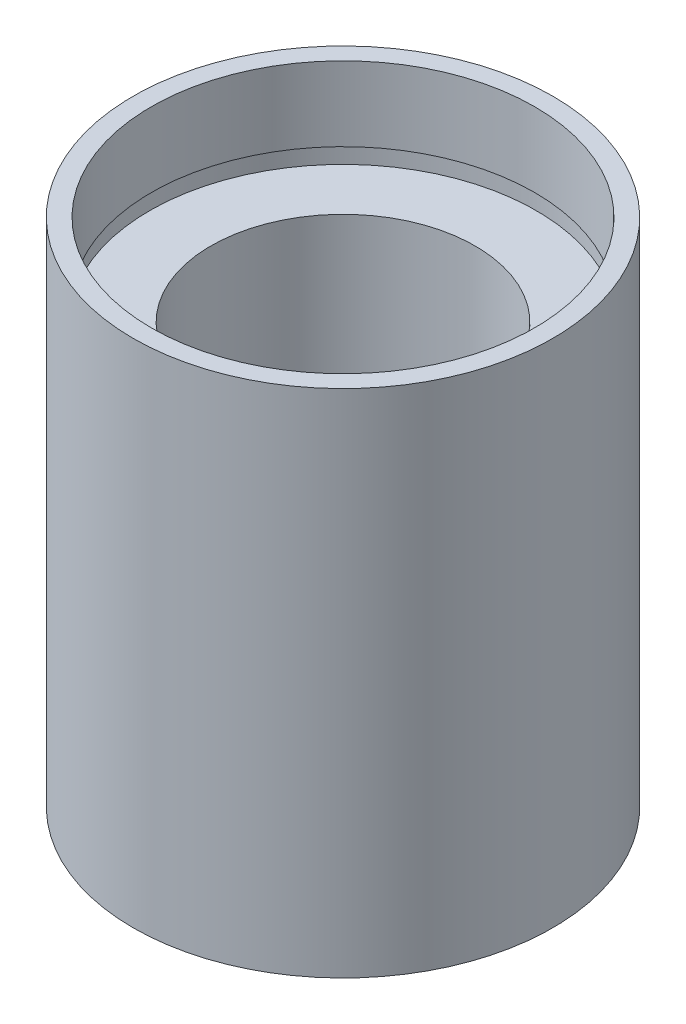
ISO-10303-21;
HEADER;
FILE_DESCRIPTION(('STEP AP214'),'2;1');
FILE_NAME('part.step','',(''),(''),'','','');
FILE_SCHEMA(('AUTOMOTIVE_DESIGN { 1 0 10303 214 1 1 1 1 }'));
ENDSEC;
DATA;
#1=APPLICATION_CONTEXT('core data for automotive mechanical design processes');
#2=APPLICATION_PROTOCOL_DEFINITION('international standard','automotive_design',2000,#1);
#3=PRODUCT_CONTEXT('',#1,'mechanical');
#4=PRODUCT('Part','Part','',(#3));
#5=PRODUCT_RELATED_PRODUCT_CATEGORY('part','',(#4));
#6=PRODUCT_DEFINITION_FORMATION('','',#4);
#7=PRODUCT_DEFINITION_CONTEXT('part definition',#1,'design');
#8=PRODUCT_DEFINITION('design','',#6,#7);
#9=PRODUCT_DEFINITION_SHAPE('','',#8);
#10=(LENGTH_UNIT() NAMED_UNIT(*) SI_UNIT(.MILLI.,.METRE.));
#11=(NAMED_UNIT(*) PLANE_ANGLE_UNIT() SI_UNIT($,.RADIAN.));
#12=(NAMED_UNIT(*) SI_UNIT($,.STERADIAN.) SOLID_ANGLE_UNIT());
#13=UNCERTAINTY_MEASURE_WITH_UNIT(LENGTH_MEASURE(1.E-05),#10,'distance_accuracy_value','');
#14=(GEOMETRIC_REPRESENTATION_CONTEXT(3) GLOBAL_UNCERTAINTY_ASSIGNED_CONTEXT((#13)) GLOBAL_UNIT_ASSIGNED_CONTEXT((#10,
#11,#12)) REPRESENTATION_CONTEXT('',''));
#15=CARTESIAN_POINT('',(0.,0.,0.));
#16=DIRECTION('',(0.,0.,1.));
#17=DIRECTION('',(1.,0.,0.));
#18=AXIS2_PLACEMENT_3D('',#15,#16,#17);
#19=CARTESIAN_POINT('',(11.1,0.,0.));
#20=DIRECTION('',(0.,1.,0.));
#21=DIRECTION('',(0.,0.,1.));
#22=AXIS2_PLACEMENT_3D('',#19,#20,#21);
#23=PLANE('',#22);
#24=CARTESIAN_POINT('',(0.,0.,0.));
#25=DIRECTION('',(0.,1.,0.));
#26=DIRECTION('',(0.,0.,1.));
#27=AXIS2_PLACEMENT_3D('',#24,#25,#26);
#28=CIRCLE('',#27,12.7);
#29=CARTESIAN_POINT('',(0.,0.,12.7));
#30=VERTEX_POINT('',#29);
#31=EDGE_CURVE('E10',#30,#30,#28,.T.);
#32=ORIENTED_EDGE('',*,*,#31,.F.);
#33=EDGE_LOOP('',(#32));
#34=FACE_BOUND('',#33,.T.);
#35=CARTESIAN_POINT('',(0.,0.,0.));
#36=DIRECTION('',(0.,1.,0.));
#37=DIRECTION('',(0.,0.,1.));
#38=AXIS2_PLACEMENT_3D('',#35,#36,#37);
#39=CIRCLE('',#38,11.1);
#40=CARTESIAN_POINT('',(0.,0.,11.1));
#41=VERTEX_POINT('',#40);
#42=EDGE_CURVE('E77',#41,#41,#39,.T.);
#43=ORIENTED_EDGE('',*,*,#42,.T.);
#44=EDGE_LOOP('',(#43));
#45=FACE_BOUND('',#44,.T.);
#46=ADVANCED_FACE('F37',(#34,#45),#23,.F.);
#47=CARTESIAN_POINT('',(0.,161.376166943427,0.));
#48=DIRECTION('',(0.,1.,0.));
#49=DIRECTION('',(0.,0.,1.));
#50=AXIS2_PLACEMENT_3D('',#47,#48,#49);
#51=CYLINDRICAL_SURFACE('',#50,12.7);
#52=CARTESIAN_POINT('',(0.,30.9,0.));
#53=DIRECTION('',(0.,1.,0.));
#54=DIRECTION('',(0.,0.,1.));
#55=AXIS2_PLACEMENT_3D('',#52,#53,#54);
#56=CIRCLE('',#55,12.7);
#57=CARTESIAN_POINT('',(0.,30.9,12.7));
#58=VERTEX_POINT('',#57);
#59=EDGE_CURVE('E43',#58,#58,#56,.T.);
#60=ORIENTED_EDGE('',*,*,#59,.F.);
#61=EDGE_LOOP('',(#60));
#62=FACE_BOUND('',#61,.T.);
#63=ORIENTED_EDGE('',*,*,#31,.T.);
#64=EDGE_LOOP('',(#63));
#65=FACE_BOUND('',#64,.T.);
#66=ADVANCED_FACE('F138',(#62,#65),#51,.T.);
#67=CARTESIAN_POINT('',(11.6,30.9,0.));
#68=DIRECTION('',(0.,-1.,0.));
#69=DIRECTION('',(0.,0.,-1.));
#70=AXIS2_PLACEMENT_3D('',#67,#68,#69);
#71=PLANE('',#70);
#72=CARTESIAN_POINT('',(0.,30.9,0.));
#73=DIRECTION('',(0.,1.,0.));
#74=DIRECTION('',(0.,0.,1.));
#75=AXIS2_PLACEMENT_3D('',#72,#73,#74);
#76=CIRCLE('',#75,11.6);
#77=CARTESIAN_POINT('',(0.,30.9,11.6));
#78=VERTEX_POINT('',#77);
#79=EDGE_CURVE('E47',#78,#78,#76,.T.);
#80=ORIENTED_EDGE('',*,*,#79,.F.);
#81=EDGE_LOOP('',(#80));
#82=FACE_BOUND('',#81,.T.);
#83=ORIENTED_EDGE('',*,*,#59,.T.);
#84=EDGE_LOOP('',(#83));
#85=FACE_BOUND('',#84,.T.);
#86=ADVANCED_FACE('F133',(#82,#85),#71,.F.);
#87=CARTESIAN_POINT('',(0.,161.376166943427,0.));
#88=DIRECTION('',(0.,1.,0.));
#89=DIRECTION('',(0.,0.,1.));
#90=AXIS2_PLACEMENT_3D('',#87,#88,#89);
#91=CYLINDRICAL_SURFACE('',#90,11.6);
#92=CARTESIAN_POINT('',(0.,26.4,0.));
#93=DIRECTION('',(0.,1.,0.));
#94=DIRECTION('',(0.,0.,1.));
#95=AXIS2_PLACEMENT_3D('',#92,#93,#94);
#96=CIRCLE('',#95,11.6);
#97=CARTESIAN_POINT('',(0.,26.4,11.6));
#98=VERTEX_POINT('',#97);
#99=EDGE_CURVE('E51',#98,#98,#96,.T.);
#100=ORIENTED_EDGE('',*,*,#99,.F.);
#101=EDGE_LOOP('',(#100));
#102=FACE_BOUND('',#101,.T.);
#103=ORIENTED_EDGE('',*,*,#79,.T.);
#104=EDGE_LOOP('',(#103));
#105=FACE_BOUND('',#104,.T.);
#106=ADVANCED_FACE('F127',(#102,#105),#91,.F.);
#107=CARTESIAN_POINT('',(11.6,26.4,0.));
#108=DIRECTION('',(0.,1.,0.));
#109=DIRECTION('',(0.,0.,1.));
#110=AXIS2_PLACEMENT_3D('',#107,#108,#109);
#111=PLANE('',#110);
#112=CARTESIAN_POINT('',(0.,26.4,0.));
#113=DIRECTION('',(0.,1.,0.));
#114=DIRECTION('',(0.,0.,1.));
#115=AXIS2_PLACEMENT_3D('',#112,#113,#114);
#116=CIRCLE('',#115,11.7);
#117=CARTESIAN_POINT('',(0.,26.4,11.7));
#118=VERTEX_POINT('',#117);
#119=EDGE_CURVE('E56',#118,#118,#116,.T.);
#120=ORIENTED_EDGE('',*,*,#119,.F.);
#121=EDGE_LOOP('',(#120));
#122=FACE_BOUND('',#121,.T.);
#123=ORIENTED_EDGE('',*,*,#99,.T.);
#124=EDGE_LOOP('',(#123));
#125=FACE_BOUND('',#124,.T.);
#126=ADVANCED_FACE('F121',(#122,#125),#111,.F.);
#127=CARTESIAN_POINT('',(0.,161.376166943427,0.));
#128=DIRECTION('',(0.,1.,0.));
#129=DIRECTION('',(0.,0.,1.));
#130=AXIS2_PLACEMENT_3D('',#127,#128,#129);
#131=CYLINDRICAL_SURFACE('',#130,11.7);
#132=CARTESIAN_POINT('',(0.,25.4,0.));
#133=DIRECTION('',(0.,1.,0.));
#134=DIRECTION('',(0.,0.,1.));
#135=AXIS2_PLACEMENT_3D('',#132,#133,#134);
#136=CIRCLE('',#135,11.7);
#137=CARTESIAN_POINT('',(0.,25.4,11.7));
#138=VERTEX_POINT('',#137);
#139=EDGE_CURVE('E59',#138,#138,#136,.T.);
#140=ORIENTED_EDGE('',*,*,#139,.F.);
#141=EDGE_LOOP('',(#140));
#142=FACE_BOUND('',#141,.T.);
#143=ORIENTED_EDGE('',*,*,#119,.T.);
#144=EDGE_LOOP('',(#143));
#145=FACE_BOUND('',#144,.T.);
#146=ADVANCED_FACE('F115',(#142,#145),#131,.F.);
#147=CARTESIAN_POINT('',(8.00000000000002,25.4,0.));
#148=DIRECTION('',(0.,-1.,0.));
#149=DIRECTION('',(0.,0.,-1.));
#150=AXIS2_PLACEMENT_3D('',#147,#148,#149);
#151=PLANE('',#150);
#152=CARTESIAN_POINT('',(0.,25.4,0.));
#153=DIRECTION('',(0.,1.,0.));
#154=DIRECTION('',(0.,0.,1.));
#155=AXIS2_PLACEMENT_3D('',#152,#153,#154);
#156=CIRCLE('',#155,8.00000000000002);
#157=CARTESIAN_POINT('',(0.,25.4,8.00000000000002));
#158=VERTEX_POINT('',#157);
#159=EDGE_CURVE('E62',#158,#158,#156,.T.);
#160=ORIENTED_EDGE('',*,*,#159,.F.);
#161=EDGE_LOOP('',(#160));
#162=FACE_BOUND('',#161,.T.);
#163=ORIENTED_EDGE('',*,*,#139,.T.);
#164=EDGE_LOOP('',(#163));
#165=FACE_BOUND('',#164,.T.);
#166=ADVANCED_FACE('F109',(#162,#165),#151,.F.);
#167=CARTESIAN_POINT('',(0.,161.376166943427,0.));
#168=DIRECTION('',(0.,1.,0.));
#169=DIRECTION('',(0.,0.,1.));
#170=AXIS2_PLACEMENT_3D('',#167,#168,#169);
#171=CYLINDRICAL_SURFACE('',#170,8.00000000000002);
#172=CARTESIAN_POINT('',(0.,5.49999999999998,0.));
#173=DIRECTION('',(0.,1.,0.));
#174=DIRECTION('',(0.,0.,1.));
#175=AXIS2_PLACEMENT_3D('',#172,#173,#174);
#176=CIRCLE('',#175,8.00000000000002);
#177=CARTESIAN_POINT('',(0.,5.49999999999998,8.00000000000002));
#178=VERTEX_POINT('',#177);
#179=EDGE_CURVE('E65',#178,#178,#176,.T.);
#180=ORIENTED_EDGE('',*,*,#179,.F.);
#181=EDGE_LOOP('',(#180));
#182=FACE_BOUND('',#181,.T.);
#183=ORIENTED_EDGE('',*,*,#159,.T.);
#184=EDGE_LOOP('',(#183));
#185=FACE_BOUND('',#184,.T.);
#186=ADVANCED_FACE('F103',(#182,#185),#171,.F.);
#187=CARTESIAN_POINT('',(11.7,5.49999999999999,0.));
#188=DIRECTION('',(0.,1.,0.));
#189=DIRECTION('',(0.,0.,1.));
#190=AXIS2_PLACEMENT_3D('',#187,#188,#189);
#191=PLANE('',#190);
#192=CARTESIAN_POINT('',(0.,5.49999999999998,0.));
#193=DIRECTION('',(0.,1.,0.));
#194=DIRECTION('',(0.,0.,1.));
#195=AXIS2_PLACEMENT_3D('',#192,#193,#194);
#196=CIRCLE('',#195,11.7);
#197=CARTESIAN_POINT('',(0.,5.49999999999998,11.7));
#198=VERTEX_POINT('',#197);
#199=EDGE_CURVE('E68',#198,#198,#196,.T.);
#200=ORIENTED_EDGE('',*,*,#199,.F.);
#201=EDGE_LOOP('',(#200));
#202=FACE_BOUND('',#201,.T.);
#203=ORIENTED_EDGE('',*,*,#179,.T.);
#204=EDGE_LOOP('',(#203));
#205=FACE_BOUND('',#204,.T.);
#206=ADVANCED_FACE('F97',(#202,#205),#191,.F.);
#207=CARTESIAN_POINT('',(0.,161.376166943427,0.));
#208=DIRECTION('',(0.,1.,0.));
#209=DIRECTION('',(0.,0.,1.));
#210=AXIS2_PLACEMENT_3D('',#207,#208,#209);
#211=CYLINDRICAL_SURFACE('',#210,11.7);
#212=CARTESIAN_POINT('',(0.,4.49999999999998,0.));
#213=DIRECTION('',(0.,1.,0.));
#214=DIRECTION('',(0.,0.,1.));
#215=AXIS2_PLACEMENT_3D('',#212,#213,#214);
#216=CIRCLE('',#215,11.7);
#217=CARTESIAN_POINT('',(0.,4.49999999999998,11.7));
#218=VERTEX_POINT('',#217);
#219=EDGE_CURVE('E71',#218,#218,#216,.T.);
#220=ORIENTED_EDGE('',*,*,#219,.F.);
#221=EDGE_LOOP('',(#220));
#222=FACE_BOUND('',#221,.T.);
#223=ORIENTED_EDGE('',*,*,#199,.T.);
#224=EDGE_LOOP('',(#223));
#225=FACE_BOUND('',#224,.T.);
#226=ADVANCED_FACE('F91',(#222,#225),#211,.F.);
#227=CARTESIAN_POINT('',(11.1,4.49999999999998,0.));
#228=DIRECTION('',(0.,-1.,0.));
#229=DIRECTION('',(0.,0.,-1.));
#230=AXIS2_PLACEMENT_3D('',#227,#228,#229);
#231=PLANE('',#230);
#232=CARTESIAN_POINT('',(0.,4.49999999999998,0.));
#233=DIRECTION('',(0.,1.,0.));
#234=DIRECTION('',(0.,0.,1.));
#235=AXIS2_PLACEMENT_3D('',#232,#233,#234);
#236=CIRCLE('',#235,11.1);
#237=CARTESIAN_POINT('',(0.,4.49999999999998,11.1));
#238=VERTEX_POINT('',#237);
#239=EDGE_CURVE('E74',#238,#238,#236,.T.);
#240=ORIENTED_EDGE('',*,*,#239,.F.);
#241=EDGE_LOOP('',(#240));
#242=FACE_BOUND('',#241,.T.);
#243=ORIENTED_EDGE('',*,*,#219,.T.);
#244=EDGE_LOOP('',(#243));
#245=FACE_BOUND('',#244,.T.);
#246=ADVANCED_FACE('F85',(#242,#245),#231,.F.);
#247=CARTESIAN_POINT('',(0.,161.376166943427,0.));
#248=DIRECTION('',(0.,1.,0.));
#249=DIRECTION('',(0.,0.,1.));
#250=AXIS2_PLACEMENT_3D('',#247,#248,#249);
#251=CYLINDRICAL_SURFACE('',#250,11.1);
#252=ORIENTED_EDGE('',*,*,#42,.F.);
#253=EDGE_LOOP('',(#252));
#254=FACE_BOUND('',#253,.T.);
#255=ORIENTED_EDGE('',*,*,#239,.T.);
#256=EDGE_LOOP('',(#255));
#257=FACE_BOUND('',#256,.T.);
#258=ADVANCED_FACE('F82',(#254,#257),#251,.F.);
#259=CLOSED_SHELL('',(#46,#66,#86,#106,#126,#146,#166,#186,#206,#226,#246,#258));
#260=MANIFOLD_SOLID_BREP('B2',#259);
#261=ADVANCED_BREP_SHAPE_REPRESENTATION('',(#18,#260),#14);
#262=SHAPE_DEFINITION_REPRESENTATION(#9,#261);
ENDSEC;
END-ISO-10303-21;
